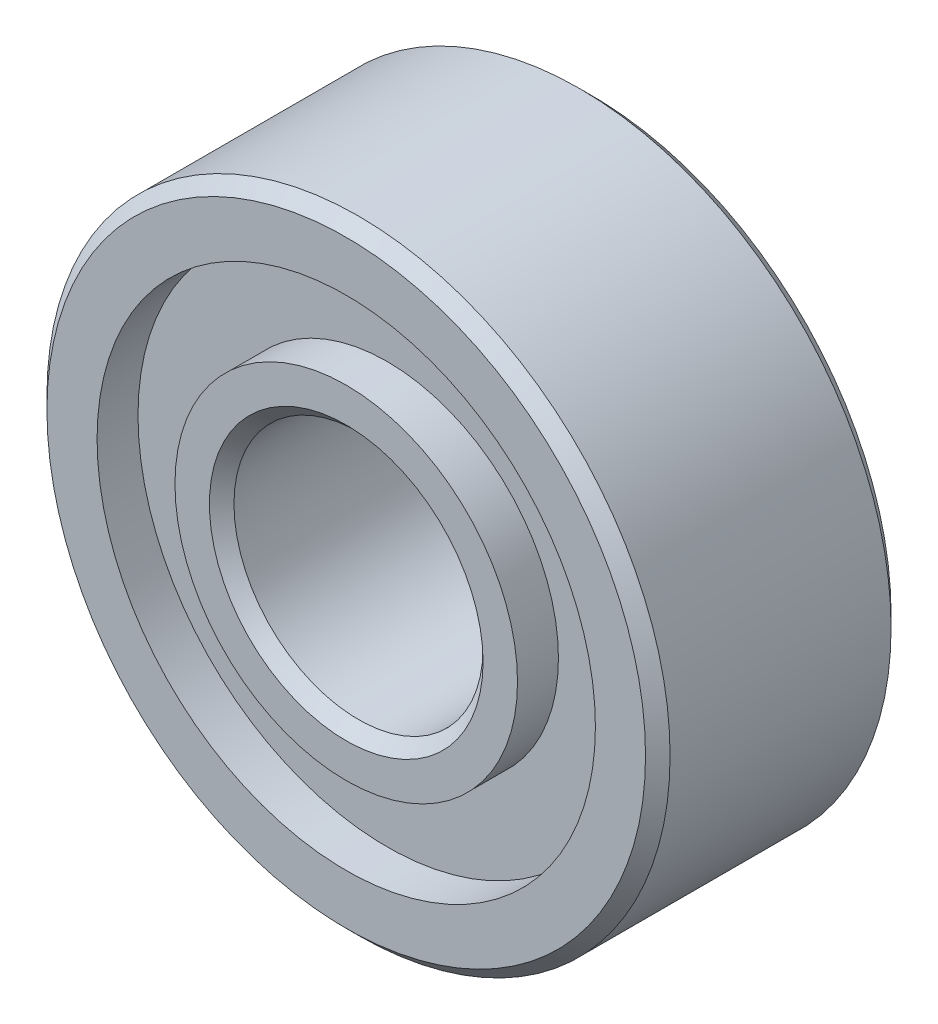
ISO-10303-21;
HEADER;
FILE_DESCRIPTION(('STEP AP214'),'2;1');
FILE_NAME('part.step','',(''),(''),'','','');
FILE_SCHEMA(('AUTOMOTIVE_DESIGN { 1 0 10303 214 1 1 1 1 }'));
ENDSEC;
DATA;
#1=APPLICATION_CONTEXT('core data for automotive mechanical design processes');
#2=APPLICATION_PROTOCOL_DEFINITION('international standard','automotive_design',2000,#1);
#3=PRODUCT_CONTEXT('',#1,'mechanical');
#4=PRODUCT('Part','Part','',(#3));
#5=PRODUCT_RELATED_PRODUCT_CATEGORY('part','',(#4));
#6=PRODUCT_DEFINITION_FORMATION('','',#4);
#7=PRODUCT_DEFINITION_CONTEXT('part definition',#1,'design');
#8=PRODUCT_DEFINITION('design','',#6,#7);
#9=PRODUCT_DEFINITION_SHAPE('','',#8);
#10=(LENGTH_UNIT() NAMED_UNIT(*) SI_UNIT(.MILLI.,.METRE.));
#11=(NAMED_UNIT(*) PLANE_ANGLE_UNIT() SI_UNIT($,.RADIAN.));
#12=(NAMED_UNIT(*) SI_UNIT($,.STERADIAN.) SOLID_ANGLE_UNIT());
#13=UNCERTAINTY_MEASURE_WITH_UNIT(LENGTH_MEASURE(1.E-05),#10,'distance_accuracy_value','');
#14=(GEOMETRIC_REPRESENTATION_CONTEXT(3) GLOBAL_UNCERTAINTY_ASSIGNED_CONTEXT((#13)) GLOBAL_UNIT_ASSIGNED_CONTEXT((#10,
#11,#12)) REPRESENTATION_CONTEXT('',''));
#15=CARTESIAN_POINT('',(0.,0.,0.));
#16=DIRECTION('',(0.,0.,1.));
#17=DIRECTION('',(1.,0.,0.));
#18=AXIS2_PLACEMENT_3D('',#15,#16,#17);
#19=CARTESIAN_POINT('',(0.,0.,0.656666666666667));
#20=DIRECTION('',(0.,0.,1.));
#21=DIRECTION('',(1.,0.,0.));
#22=AXIS2_PLACEMENT_3D('',#19,#20,#21);
#23=PLANE('',#22);
#24=CARTESIAN_POINT('',(0.,0.,0.656666666666667));
#25=DIRECTION('',(0.,0.,-1.));
#26=DIRECTION('',(-1.,0.,0.));
#27=AXIS2_PLACEMENT_3D('',#24,#25,#26);
#28=CIRCLE('',#27,3.99841666666668);
#29=CARTESIAN_POINT('',(-3.99841666666668,0.,0.656666666666667));
#30=VERTEX_POINT('',#29);
#31=EDGE_CURVE('E76',#30,#30,#28,.T.);
#32=ORIENTED_EDGE('',*,*,#31,.T.);
#33=EDGE_LOOP('',(#32));
#34=FACE_BOUND('',#33,.T.);
#35=CARTESIAN_POINT('',(0.,0.,0.656666666666667));
#36=DIRECTION('',(0.,0.,1.));
#37=DIRECTION('',(1.,0.,0.));
#38=AXIS2_PLACEMENT_3D('',#35,#36,#37);
#39=CIRCLE('',#38,2.748625);
#40=CARTESIAN_POINT('',(2.748625,0.,0.656666666666667));
#41=VERTEX_POINT('',#40);
#42=EDGE_CURVE('E61',#41,#41,#39,.F.);
#43=ORIENTED_EDGE('',*,*,#42,.F.);
#44=EDGE_LOOP('',(#43));
#45=FACE_BOUND('',#44,.T.);
#46=ADVANCED_FACE('F29',(#34,#45),#23,.F.);
#47=CARTESIAN_POINT('',(0.,0.,3.28333333333333));
#48=DIRECTION('',(0.,0.,-1.));
#49=DIRECTION('',(-1.,0.,0.));
#50=AXIS2_PLACEMENT_3D('',#47,#48,#49);
#51=PLANE('',#50);
#52=CARTESIAN_POINT('',(0.,0.,3.28333333333333));
#53=DIRECTION('',(0.,0.,1.));
#54=DIRECTION('',(1.,0.,0.));
#55=AXIS2_PLACEMENT_3D('',#52,#53,#54);
#56=CIRCLE('',#55,3.99841666666668);
#57=CARTESIAN_POINT('',(3.99841666666668,0.,3.28333333333333));
#58=VERTEX_POINT('',#57);
#59=EDGE_CURVE('E67',#58,#58,#56,.T.);
#60=ORIENTED_EDGE('',*,*,#59,.T.);
#61=EDGE_LOOP('',(#60));
#62=FACE_BOUND('',#61,.T.);
#63=CARTESIAN_POINT('',(0.,0.,3.28333333333333));
#64=DIRECTION('',(0.,0.,-1.));
#65=DIRECTION('',(-1.,0.,0.));
#66=AXIS2_PLACEMENT_3D('',#63,#64,#65);
#67=CIRCLE('',#66,2.748625);
#68=CARTESIAN_POINT('',(-2.748625,0.,3.28333333333333));
#69=VERTEX_POINT('',#68);
#70=EDGE_CURVE('E64',#69,#69,#67,.F.);
#71=ORIENTED_EDGE('',*,*,#70,.F.);
#72=EDGE_LOOP('',(#71));
#73=FACE_BOUND('',#72,.T.);
#74=ADVANCED_FACE('F96',(#62,#73),#51,.F.);
#75=CARTESIAN_POINT('',(0.,0.,0.));
#76=DIRECTION('',(0.,0.,1.));
#77=DIRECTION('',(1.,0.,0.));
#78=AXIS2_PLACEMENT_3D('',#75,#76,#77);
#79=CYLINDRICAL_SURFACE('',#78,5.);
#80=CARTESIAN_POINT('',(0.,0.,0.19700000001394));
#81=DIRECTION('',(0.,0.,-1.));
#82=DIRECTION('',(-1.,0.,0.));
#83=AXIS2_PLACEMENT_3D('',#80,#81,#82);
#84=CIRCLE('',#83,5.);
#85=CARTESIAN_POINT('',(-5.,0.,0.19700000001394));
#86=VERTEX_POINT('',#85);
#87=EDGE_CURVE('E55',#86,#86,#84,.F.);
#88=ORIENTED_EDGE('',*,*,#87,.T.);
#89=EDGE_LOOP('',(#88));
#90=FACE_BOUND('',#89,.T.);
#91=CARTESIAN_POINT('',(0.,0.,3.74299999992922));
#92=DIRECTION('',(0.,0.,-1.));
#93=DIRECTION('',(-1.,0.,0.));
#94=AXIS2_PLACEMENT_3D('',#91,#92,#93);
#95=CIRCLE('',#94,5.);
#96=CARTESIAN_POINT('',(-5.,0.,3.74299999992922));
#97=VERTEX_POINT('',#96);
#98=EDGE_CURVE('E58',#97,#97,#95,.T.);
#99=ORIENTED_EDGE('',*,*,#98,.T.);
#100=EDGE_LOOP('',(#99));
#101=FACE_BOUND('',#100,.T.);
#102=ADVANCED_FACE('F31',(#90,#101),#79,.T.);
#103=CARTESIAN_POINT('',(0.,0.,0.));
#104=DIRECTION('',(0.,0.,-1.));
#105=DIRECTION('',(-1.,0.,0.));
#106=AXIS2_PLACEMENT_3D('',#103,#104,#105);
#107=PLANE('',#106);
#108=CARTESIAN_POINT('',(0.,0.,0.));
#109=DIRECTION('',(0.,0.,-1.));
#110=DIRECTION('',(-1.,0.,0.));
#111=AXIS2_PLACEMENT_3D('',#108,#109,#110);
#112=CIRCLE('',#111,4.80299999992921);
#113=CARTESIAN_POINT('',(-4.80299999992921,0.,0.));
#114=VERTEX_POINT('',#113);
#115=EDGE_CURVE('E52',#114,#114,#112,.T.);
#116=ORIENTED_EDGE('',*,*,#115,.T.);
#117=EDGE_LOOP('',(#116));
#118=FACE_BOUND('',#117,.T.);
#119=CARTESIAN_POINT('',(0.,0.,0.));
#120=DIRECTION('',(0.,0.,-1.));
#121=DIRECTION('',(-1.,0.,0.));
#122=AXIS2_PLACEMENT_3D('',#119,#120,#121);
#123=CIRCLE('',#122,3.99841666666668);
#124=CARTESIAN_POINT('',(-3.99841666666668,0.,0.));
#125=VERTEX_POINT('',#124);
#126=EDGE_CURVE('E79',#125,#125,#123,.T.);
#127=ORIENTED_EDGE('',*,*,#126,.F.);
#128=EDGE_LOOP('',(#127));
#129=FACE_BOUND('',#128,.T.);
#130=ADVANCED_FACE('F119',(#118,#129),#107,.T.);
#131=CARTESIAN_POINT('',(0.,0.,3.94));
#132=DIRECTION('',(0.,0.,-1.));
#133=DIRECTION('',(-1.,0.,0.));
#134=AXIS2_PLACEMENT_3D('',#131,#132,#133);
#135=PLANE('',#134);
#136=CARTESIAN_POINT('',(0.,0.,3.94));
#137=DIRECTION('',(0.,0.,-1.));
#138=DIRECTION('',(-1.,0.,0.));
#139=AXIS2_PLACEMENT_3D('',#136,#137,#138);
#140=CIRCLE('',#139,4.80299999998606);
#141=CARTESIAN_POINT('',(-4.80299999998606,0.,3.94));
#142=VERTEX_POINT('',#141);
#143=EDGE_CURVE('E49',#142,#142,#140,.F.);
#144=ORIENTED_EDGE('',*,*,#143,.T.);
#145=EDGE_LOOP('',(#144));
#146=FACE_BOUND('',#145,.T.);
#147=CARTESIAN_POINT('',(0.,0.,3.94));
#148=DIRECTION('',(0.,0.,1.));
#149=DIRECTION('',(1.,0.,0.));
#150=AXIS2_PLACEMENT_3D('',#147,#148,#149);
#151=CIRCLE('',#150,3.99841666666668);
#152=CARTESIAN_POINT('',(3.99841666666668,0.,3.94));
#153=VERTEX_POINT('',#152);
#154=EDGE_CURVE('E70',#153,#153,#151,.T.);
#155=ORIENTED_EDGE('',*,*,#154,.F.);
#156=EDGE_LOOP('',(#155));
#157=FACE_BOUND('',#156,.T.);
#158=ADVANCED_FACE('F115',(#146,#157),#135,.F.);
#159=CARTESIAN_POINT('',(0.,0.,3.94));
#160=DIRECTION('',(0.,0.,1.));
#161=DIRECTION('',(1.,0.,0.));
#162=AXIS2_PLACEMENT_3D('',#159,#160,#161);
#163=CYLINDRICAL_SURFACE('',#162,3.99841666666668);
#164=ORIENTED_EDGE('',*,*,#59,.F.);
#165=EDGE_LOOP('',(#164));
#166=FACE_BOUND('',#165,.T.);
#167=ORIENTED_EDGE('',*,*,#154,.T.);
#168=EDGE_LOOP('',(#167));
#169=FACE_BOUND('',#168,.T.);
#170=ADVANCED_FACE('F112',(#166,#169),#163,.F.);
#171=CARTESIAN_POINT('',(0.,0.,3.94));
#172=DIRECTION('',(0.,0.,-1.));
#173=DIRECTION('',(-1.,0.,0.));
#174=AXIS2_PLACEMENT_3D('',#171,#172,#173);
#175=CYLINDRICAL_SURFACE('',#174,2.748625);
#176=CARTESIAN_POINT('',(0.,0.,3.94));
#177=DIRECTION('',(0.,0.,1.));
#178=DIRECTION('',(1.,0.,0.));
#179=AXIS2_PLACEMENT_3D('',#176,#177,#178);
#180=CIRCLE('',#179,2.748625);
#181=CARTESIAN_POINT('',(2.748625,0.,3.94));
#182=VERTEX_POINT('',#181);
#183=EDGE_CURVE('E73',#182,#182,#180,.T.);
#184=ORIENTED_EDGE('',*,*,#183,.F.);
#185=EDGE_LOOP('',(#184));
#186=FACE_BOUND('',#185,.T.);
#187=ORIENTED_EDGE('',*,*,#70,.T.);
#188=EDGE_LOOP('',(#187));
#189=FACE_BOUND('',#188,.T.);
#190=ADVANCED_FACE('F109',(#186,#189),#175,.T.);
#191=CARTESIAN_POINT('',(0.,0.,3.94));
#192=DIRECTION('',(0.,0.,1.));
#193=DIRECTION('',(1.,0.,0.));
#194=AXIS2_PLACEMENT_3D('',#191,#192,#193);
#195=PLANE('',#194);
#196=CARTESIAN_POINT('',(0.,0.,3.94));
#197=DIRECTION('',(0.,0.,1.));
#198=DIRECTION('',(1.,0.,0.));
#199=AXIS2_PLACEMENT_3D('',#196,#197,#198);
#200=CIRCLE('',#199,2.1957500000708);
#201=CARTESIAN_POINT('',(2.1957500000708,0.,3.94));
#202=VERTEX_POINT('',#201);
#203=EDGE_CURVE('E36',#202,#202,#200,.F.);
#204=ORIENTED_EDGE('',*,*,#203,.T.);
#205=EDGE_LOOP('',(#204));
#206=FACE_BOUND('',#205,.T.);
#207=ORIENTED_EDGE('',*,*,#183,.T.);
#208=EDGE_LOOP('',(#207));
#209=FACE_BOUND('',#208,.T.);
#210=ADVANCED_FACE('F106',(#206,#209),#195,.T.);
#211=CARTESIAN_POINT('',(0.,0.,0.));
#212=DIRECTION('',(0.,0.,-1.));
#213=DIRECTION('',(-1.,0.,0.));
#214=AXIS2_PLACEMENT_3D('',#211,#212,#213);
#215=CYLINDRICAL_SURFACE('',#214,3.99841666666668);
#216=ORIENTED_EDGE('',*,*,#31,.F.);
#217=EDGE_LOOP('',(#216));
#218=FACE_BOUND('',#217,.T.);
#219=ORIENTED_EDGE('',*,*,#126,.T.);
#220=EDGE_LOOP('',(#219));
#221=FACE_BOUND('',#220,.T.);
#222=ADVANCED_FACE('F91',(#218,#221),#215,.F.);
#223=CARTESIAN_POINT('',(0.,0.,0.));
#224=DIRECTION('',(0.,0.,1.));
#225=DIRECTION('',(1.,0.,0.));
#226=AXIS2_PLACEMENT_3D('',#223,#224,#225);
#227=CYLINDRICAL_SURFACE('',#226,2.748625);
#228=CARTESIAN_POINT('',(0.,0.,0.));
#229=DIRECTION('',(0.,0.,-1.));
#230=DIRECTION('',(-1.,0.,0.));
#231=AXIS2_PLACEMENT_3D('',#228,#229,#230);
#232=CIRCLE('',#231,2.748625);
#233=CARTESIAN_POINT('',(-2.748625,0.,0.));
#234=VERTEX_POINT('',#233);
#235=EDGE_CURVE('E82',#234,#234,#232,.T.);
#236=ORIENTED_EDGE('',*,*,#235,.F.);
#237=EDGE_LOOP('',(#236));
#238=FACE_BOUND('',#237,.T.);
#239=ORIENTED_EDGE('',*,*,#42,.T.);
#240=EDGE_LOOP('',(#239));
#241=FACE_BOUND('',#240,.T.);
#242=ADVANCED_FACE('F88',(#238,#241),#227,.T.);
#243=CARTESIAN_POINT('',(0.,0.,0.));
#244=DIRECTION('',(0.,0.,-1.));
#245=DIRECTION('',(-1.,0.,0.));
#246=AXIS2_PLACEMENT_3D('',#243,#244,#245);
#247=PLANE('',#246);
#248=CARTESIAN_POINT('',(0.,0.,0.));
#249=DIRECTION('',(0.,0.,-1.));
#250=DIRECTION('',(-1.,0.,0.));
#251=AXIS2_PLACEMENT_3D('',#248,#249,#250);
#252=CIRCLE('',#251,2.1957500000708);
#253=CARTESIAN_POINT('',(-2.1957500000708,0.,0.));
#254=VERTEX_POINT('',#253);
#255=EDGE_CURVE('E10',#254,#254,#252,.F.);
#256=ORIENTED_EDGE('',*,*,#255,.T.);
#257=EDGE_LOOP('',(#256));
#258=FACE_BOUND('',#257,.T.);
#259=ORIENTED_EDGE('',*,*,#235,.T.);
#260=EDGE_LOOP('',(#259));
#261=FACE_BOUND('',#260,.T.);
#262=ADVANCED_FACE('F86',(#258,#261),#247,.T.);
#263=CARTESIAN_POINT('',(0.,0.,0.));
#264=DIRECTION('',(0.,0.,-1.));
#265=DIRECTION('',(-1.,0.,0.));
#266=AXIS2_PLACEMENT_3D('',#263,#264,#265);
#267=CYLINDRICAL_SURFACE('',#266,1.99875000000001);
#268=CARTESIAN_POINT('',(0.,0.,3.74299999998606));
#269=DIRECTION('',(0.,0.,1.));
#270=DIRECTION('',(1.,0.,0.));
#271=AXIS2_PLACEMENT_3D('',#268,#269,#270);
#272=CIRCLE('',#271,1.99875000000001);
#273=CARTESIAN_POINT('',(1.99875000000001,0.,3.74299999998606));
#274=VERTEX_POINT('',#273);
#275=EDGE_CURVE('E40',#274,#274,#272,.T.);
#276=ORIENTED_EDGE('',*,*,#275,.T.);
#277=EDGE_LOOP('',(#276));
#278=FACE_BOUND('',#277,.T.);
#279=CARTESIAN_POINT('',(0.,0.,0.197000000013944));
#280=DIRECTION('',(0.,0.,-1.));
#281=DIRECTION('',(-1.,0.,0.));
#282=AXIS2_PLACEMENT_3D('',#279,#280,#281);
#283=CIRCLE('',#282,1.99875000000001);
#284=CARTESIAN_POINT('',(-1.99875000000001,0.,0.197000000013944));
#285=VERTEX_POINT('',#284);
#286=EDGE_CURVE('E44',#285,#285,#283,.T.);
#287=ORIENTED_EDGE('',*,*,#286,.T.);
#288=EDGE_LOOP('',(#287));
#289=FACE_BOUND('',#288,.T.);
#290=ADVANCED_FACE('F150',(#278,#289),#267,.F.);
#291=CARTESIAN_POINT('',(0.,0.,0.19700000001394));
#292=DIRECTION('',(0.,0.,1.));
#293=DIRECTION('',(1.,0.,0.));
#294=AXIS2_PLACEMENT_3D('',#291,#292,#293);
#295=CONICAL_SURFACE('',#294,5.,0.785398163541725);
#296=ORIENTED_EDGE('',*,*,#115,.F.);
#297=EDGE_LOOP('',(#296));
#298=FACE_BOUND('',#297,.T.);
#299=ORIENTED_EDGE('',*,*,#87,.F.);
#300=EDGE_LOOP('',(#299));
#301=FACE_BOUND('',#300,.T.);
#302=ADVANCED_FACE('F157',(#298,#301),#295,.T.);
#303=CARTESIAN_POINT('',(0.,0.,3.94));
#304=DIRECTION('',(0.,0.,-1.));
#305=DIRECTION('',(-1.,0.,0.));
#306=AXIS2_PLACEMENT_3D('',#303,#304,#305);
#307=CONICAL_SURFACE('',#306,4.80299999998606,0.785398163253171);
#308=ORIENTED_EDGE('',*,*,#98,.F.);
#309=EDGE_LOOP('',(#308));
#310=FACE_BOUND('',#309,.T.);
#311=ORIENTED_EDGE('',*,*,#143,.F.);
#312=EDGE_LOOP('',(#311));
#313=FACE_BOUND('',#312,.T.);
#314=ADVANCED_FACE('F165',(#310,#313),#307,.T.);
#315=CARTESIAN_POINT('',(0.,0.,3.74299999998606));
#316=DIRECTION('',(0.,0.,1.));
#317=DIRECTION('',(1.,0.,0.));
#318=AXIS2_PLACEMENT_3D('',#315,#316,#317);
#319=CONICAL_SURFACE('',#318,1.99875000000001,0.785398163541723);
#320=ORIENTED_EDGE('',*,*,#203,.F.);
#321=EDGE_LOOP('',(#320));
#322=FACE_BOUND('',#321,.T.);
#323=ORIENTED_EDGE('',*,*,#275,.F.);
#324=EDGE_LOOP('',(#323));
#325=FACE_BOUND('',#324,.T.);
#326=ADVANCED_FACE('F173',(#322,#325),#319,.F.);
#327=CARTESIAN_POINT('',(0.,0.,0.197000000013944));
#328=DIRECTION('',(0.,0.,-1.));
#329=DIRECTION('',(-1.,0.,0.));
#330=AXIS2_PLACEMENT_3D('',#327,#328,#329);
#331=CONICAL_SURFACE('',#330,1.99875000000001,0.785398163541729);
#332=ORIENTED_EDGE('',*,*,#255,.F.);
#333=EDGE_LOOP('',(#332));
#334=FACE_BOUND('',#333,.T.);
#335=ORIENTED_EDGE('',*,*,#286,.F.);
#336=EDGE_LOOP('',(#335));
#337=FACE_BOUND('',#336,.T.);
#338=ADVANCED_FACE('F181',(#334,#337),#331,.F.);
#339=CLOSED_SHELL('',(#46,#74,#102,#130,#158,#170,#190,#210,#222,#242,#262,#290,#302,#314,#326,#338));
#340=MANIFOLD_SOLID_BREP('B2',#339);
#341=ADVANCED_BREP_SHAPE_REPRESENTATION('',(#18,#340),#14);
#342=SHAPE_DEFINITION_REPRESENTATION(#9,#341);
ENDSEC;
END-ISO-10303-21;
